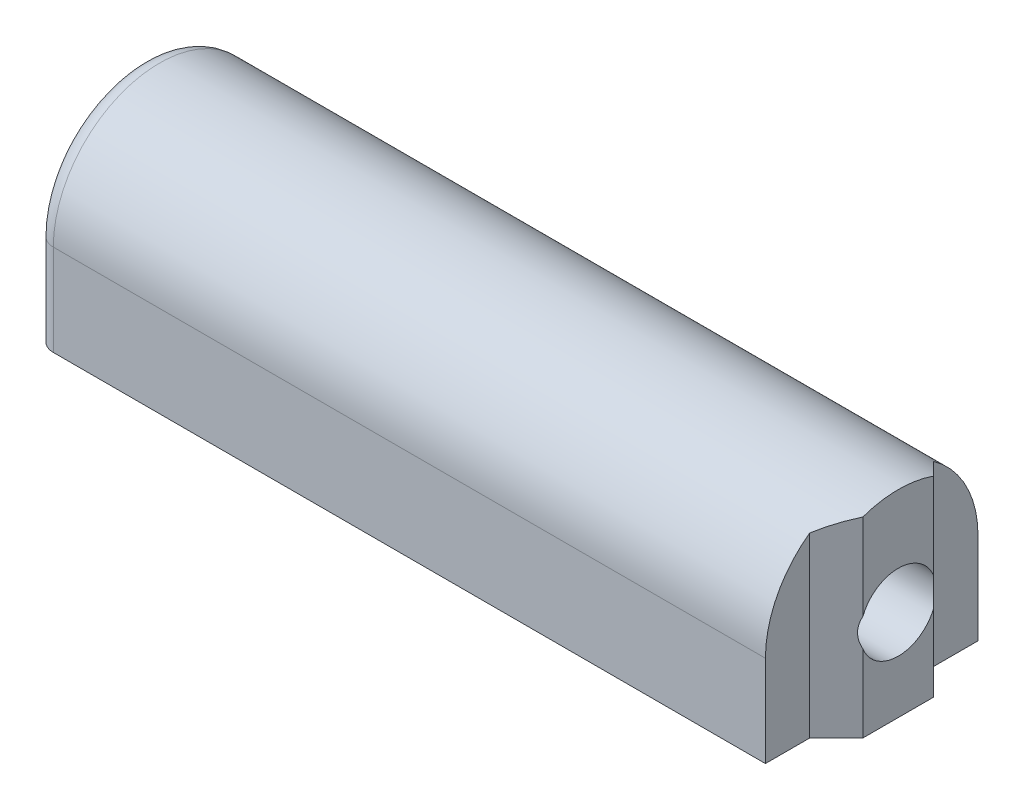
ISO-10303-21;
HEADER;
FILE_DESCRIPTION(('STEP AP214'),'2;1');
FILE_NAME('part.step','',(''),(''),'','','');
FILE_SCHEMA(('AUTOMOTIVE_DESIGN { 1 0 10303 214 1 1 1 1 }'));
ENDSEC;
DATA;
#1=APPLICATION_CONTEXT('core data for automotive mechanical design processes');
#2=APPLICATION_PROTOCOL_DEFINITION('international standard','automotive_design',2000,#1);
#3=PRODUCT_CONTEXT('',#1,'mechanical');
#4=PRODUCT('Part','Part','',(#3));
#5=PRODUCT_RELATED_PRODUCT_CATEGORY('part','',(#4));
#6=PRODUCT_DEFINITION_FORMATION('','',#4);
#7=PRODUCT_DEFINITION_CONTEXT('part definition',#1,'design');
#8=PRODUCT_DEFINITION('design','',#6,#7);
#9=PRODUCT_DEFINITION_SHAPE('','',#8);
#10=(LENGTH_UNIT() NAMED_UNIT(*) SI_UNIT(.MILLI.,.METRE.));
#11=(NAMED_UNIT(*) PLANE_ANGLE_UNIT() SI_UNIT($,.RADIAN.));
#12=(NAMED_UNIT(*) SI_UNIT($,.STERADIAN.) SOLID_ANGLE_UNIT());
#13=UNCERTAINTY_MEASURE_WITH_UNIT(LENGTH_MEASURE(1.E-05),#10,'distance_accuracy_value','');
#14=(GEOMETRIC_REPRESENTATION_CONTEXT(3) GLOBAL_UNCERTAINTY_ASSIGNED_CONTEXT((#13)) GLOBAL_UNIT_ASSIGNED_CONTEXT((#10,
#11,#12)) REPRESENTATION_CONTEXT('',''));
#15=CARTESIAN_POINT('',(0.,0.,0.));
#16=DIRECTION('',(0.,0.,1.));
#17=DIRECTION('',(1.,0.,0.));
#18=AXIS2_PLACEMENT_3D('',#15,#16,#17);
#19=CARTESIAN_POINT('',(0.,0.,12.));
#20=DIRECTION('',(0.,0.,-1.));
#21=DIRECTION('',(-1.,0.,0.));
#22=AXIS2_PLACEMENT_3D('',#19,#20,#21);
#23=PLANE('',#22);
#24=DIRECTION('',(-1.,0.,0.));
#25=VECTOR('',#24,1.);
#26=CARTESIAN_POINT('',(42.700025,5.15,12.));
#27=LINE('',#26,#25);
#28=CARTESIAN_POINT('',(41.2,5.15,12.));
#29=VERTEX_POINT('',#28);
#30=CARTESIAN_POINT('',(1.,5.15,12.));
#31=VERTEX_POINT('',#30);
#32=EDGE_CURVE('E145',#29,#31,#27,.T.);
#33=ORIENTED_EDGE('',*,*,#32,.T.);
#34=DIRECTION('',(0.,-1.,0.));
#35=VECTOR('',#34,1.);
#36=CARTESIAN_POINT('',(1.,0.,12.));
#37=LINE('',#36,#35);
#38=CARTESIAN_POINT('',(1.,0.,12.));
#39=VERTEX_POINT('',#38);
#40=EDGE_CURVE('E11',#31,#39,#37,.T.);
#41=ORIENTED_EDGE('',*,*,#40,.T.);
#42=DIRECTION('',(1.,0.,0.));
#43=VECTOR('',#42,1.);
#44=CARTESIAN_POINT('',(0.,0.,12.));
#45=LINE('',#44,#43);
#46=CARTESIAN_POINT('',(41.2,0.,12.));
#47=VERTEX_POINT('',#46);
#48=EDGE_CURVE('E151',#39,#47,#45,.T.);
#49=ORIENTED_EDGE('',*,*,#48,.T.);
#50=DIRECTION('',(0.,1.,0.));
#51=VECTOR('',#50,1.);
#52=CARTESIAN_POINT('',(41.2,0.,12.));
#53=LINE('',#52,#51);
#54=EDGE_CURVE('E154',#47,#29,#53,.T.);
#55=ORIENTED_EDGE('',*,*,#54,.T.);
#56=EDGE_LOOP('',(#33,#41,#49,#55));
#57=FACE_BOUND('',#56,.T.);
#58=ADVANCED_FACE('F36',(#57),#23,.F.);
#59=CARTESIAN_POINT('',(42.7,-7.15891053163818,8.));
#60=DIRECTION('',(1.,0.,0.));
#61=DIRECTION('',(0.,0.,-1.));
#62=AXIS2_PLACEMENT_3D('',#59,#60,#61);
#63=PLANE('',#62);
#64=CARTESIAN_POINT('',(42.7,5.15,6.));
#65=DIRECTION('',(-1.,0.,0.));
#66=DIRECTION('',(0.,0.,1.));
#67=AXIS2_PLACEMENT_3D('',#64,#65,#66);
#68=CIRCLE('',#67,6.);
#69=CARTESIAN_POINT('',(42.7,10.8068542494924,4.));
#70=VERTEX_POINT('',#69);
#71=CARTESIAN_POINT('',(42.7,10.8068542494924,8.));
#72=VERTEX_POINT('',#71);
#73=EDGE_CURVE('E198',#70,#72,#68,.F.);
#74=ORIENTED_EDGE('',*,*,#73,.T.);
#75=DIRECTION('',(0.,1.,0.));
#76=VECTOR('',#75,1.);
#77=CARTESIAN_POINT('',(42.7,-7.15891053163818,8.));
#78=LINE('',#77,#76);
#79=CARTESIAN_POINT('',(42.7,5.93898669190298,8.));
#80=VERTEX_POINT('',#79);
#81=EDGE_CURVE('E184',#80,#72,#78,.T.);
#82=ORIENTED_EDGE('',*,*,#81,.F.);
#83=CARTESIAN_POINT('',(42.7,5.15,6.));
#84=DIRECTION('',(-1.,0.,0.));
#85=DIRECTION('',(0.,0.,1.));
#86=AXIS2_PLACEMENT_3D('',#83,#84,#85);
#87=CIRCLE('',#86,2.15);
#88=CARTESIAN_POINT('',(42.7,5.93898669190298,4.));
#89=VERTEX_POINT('',#88);
#90=EDGE_CURVE('E193',#80,#89,#87,.T.);
#91=ORIENTED_EDGE('',*,*,#90,.T.);
#92=DIRECTION('',(0.,1.,0.));
#93=VECTOR('',#92,1.);
#94=CARTESIAN_POINT('',(42.7,-7.15891053163818,4.));
#95=LINE('',#94,#93);
#96=EDGE_CURVE('E261',#89,#70,#95,.T.);
#97=ORIENTED_EDGE('',*,*,#96,.T.);
#98=EDGE_LOOP('',(#74,#82,#91,#97));
#99=FACE_BOUND('',#98,.T.);
#100=ADVANCED_FACE('F259',(#99),#63,.T.);
#101=CARTESIAN_POINT('',(41.2,0.,12.));
#102=DIRECTION('',(-1.,0.,0.));
#103=DIRECTION('',(0.,0.,1.));
#104=AXIS2_PLACEMENT_3D('',#101,#102,#103);
#105=PLANE('',#104);
#106=DIRECTION('',(0.,1.,0.));
#107=VECTOR('',#106,1.);
#108=CARTESIAN_POINT('',(41.2,0.,0.));
#109=LINE('',#108,#107);
#110=CARTESIAN_POINT('',(41.2,0.,0.));
#111=VERTEX_POINT('',#110);
#112=CARTESIAN_POINT('',(41.2,5.15,0.));
#113=VERTEX_POINT('',#112);
#114=EDGE_CURVE('E143',#111,#113,#109,.T.);
#115=ORIENTED_EDGE('',*,*,#114,.T.);
#116=CARTESIAN_POINT('',(41.2,5.15,6.));
#117=DIRECTION('',(-1.,0.,0.));
#118=DIRECTION('',(0.,0.,1.));
#119=AXIS2_PLACEMENT_3D('',#116,#117,#118);
#120=CIRCLE('',#119,6.);
#121=CARTESIAN_POINT('',(41.2,10.0233971724045,2.5));
#122=VERTEX_POINT('',#121);
#123=EDGE_CURVE('E127',#113,#122,#120,.F.);
#124=ORIENTED_EDGE('',*,*,#123,.T.);
#125=DIRECTION('',(0.,1.,0.));
#126=VECTOR('',#125,1.);
#127=CARTESIAN_POINT('',(41.2,-7.15891053163818,2.5));
#128=LINE('',#127,#126);
#129=CARTESIAN_POINT('',(41.2,0.,2.5));
#130=VERTEX_POINT('',#129);
#131=EDGE_CURVE('E240',#130,#122,#128,.T.);
#132=ORIENTED_EDGE('',*,*,#131,.F.);
#133=DIRECTION('',(0.,0.,-1.));
#134=VECTOR('',#133,1.);
#135=CARTESIAN_POINT('',(41.2,0.,12.));
#136=LINE('',#135,#134);
#137=EDGE_CURVE('E150',#130,#111,#136,.T.);
#138=ORIENTED_EDGE('',*,*,#137,.T.);
#139=EDGE_LOOP('',(#115,#124,#132,#138));
#140=FACE_BOUND('',#139,.T.);
#141=ADVANCED_FACE('F148',(#140),#105,.F.);
#142=CARTESIAN_POINT('',(0.,0.,12.));
#143=DIRECTION('',(1.,0.,0.));
#144=DIRECTION('',(0.,0.,-1.));
#145=AXIS2_PLACEMENT_3D('',#142,#143,#144);
#146=PLANE('',#145);
#147=CARTESIAN_POINT('',(0.,5.15,6.));
#148=DIRECTION('',(-1.,0.,0.));
#149=DIRECTION('',(0.,0.,1.));
#150=AXIS2_PLACEMENT_3D('',#147,#148,#149);
#151=CIRCLE('',#150,2.15);
#152=CARTESIAN_POINT('',(0.,5.15,8.15));
#153=VERTEX_POINT('',#152);
#154=EDGE_CURVE('E138',#153,#153,#151,.T.);
#155=ORIENTED_EDGE('',*,*,#154,.F.);
#156=EDGE_LOOP('',(#155));
#157=FACE_BOUND('',#156,.T.);
#158=CARTESIAN_POINT('',(0.,5.15,6.));
#159=DIRECTION('',(1.,0.,0.));
#160=DIRECTION('',(0.,0.,-1.));
#161=AXIS2_PLACEMENT_3D('',#158,#159,#160);
#162=CIRCLE('',#161,5.);
#163=CARTESIAN_POINT('',(0.,5.15,11.));
#164=VERTEX_POINT('',#163);
#165=CARTESIAN_POINT('',(0.,5.15,1.));
#166=VERTEX_POINT('',#165);
#167=EDGE_CURVE('E205',#164,#166,#162,.F.);
#168=ORIENTED_EDGE('',*,*,#167,.T.);
#169=DIRECTION('',(0.,-1.,0.));
#170=VECTOR('',#169,1.);
#171=CARTESIAN_POINT('',(0.,0.,1.));
#172=LINE('',#171,#170);
#173=CARTESIAN_POINT('',(0.,0.,1.));
#174=VERTEX_POINT('',#173);
#175=EDGE_CURVE('E207',#166,#174,#172,.T.);
#176=ORIENTED_EDGE('',*,*,#175,.T.);
#177=DIRECTION('',(0.,0.,-1.));
#178=VECTOR('',#177,1.);
#179=CARTESIAN_POINT('',(0.,0.,12.));
#180=LINE('',#179,#178);
#181=CARTESIAN_POINT('',(0.,0.,11.));
#182=VERTEX_POINT('',#181);
#183=EDGE_CURVE('E162',#182,#174,#180,.T.);
#184=ORIENTED_EDGE('',*,*,#183,.F.);
#185=DIRECTION('',(0.,-1.,0.));
#186=VECTOR('',#185,1.);
#187=CARTESIAN_POINT('',(0.,0.,11.));
#188=LINE('',#187,#186);
#189=EDGE_CURVE('E203',#182,#164,#188,.F.);
#190=ORIENTED_EDGE('',*,*,#189,.T.);
#191=EDGE_LOOP('',(#168,#176,#184,#190));
#192=FACE_BOUND('',#191,.T.);
#193=ADVANCED_FACE('F223',(#157,#192),#146,.F.);
#194=CARTESIAN_POINT('',(0.,0.,12.));
#195=DIRECTION('',(0.,1.,0.));
#196=DIRECTION('',(0.,0.,1.));
#197=AXIS2_PLACEMENT_3D('',#194,#195,#196);
#198=PLANE('',#197);
#199=ORIENTED_EDGE('',*,*,#183,.T.);
#200=CARTESIAN_POINT('',(1.,0.,1.));
#201=DIRECTION('',(0.,1.,0.));
#202=DIRECTION('',(0.,0.,1.));
#203=AXIS2_PLACEMENT_3D('',#200,#201,#202);
#204=CIRCLE('',#203,1.);
#205=CARTESIAN_POINT('',(1.,0.,0.));
#206=VERTEX_POINT('',#205);
#207=EDGE_CURVE('E59',#174,#206,#204,.F.);
#208=ORIENTED_EDGE('',*,*,#207,.T.);
#209=DIRECTION('',(1.,0.,0.));
#210=VECTOR('',#209,1.);
#211=CARTESIAN_POINT('',(0.,0.,0.));
#212=LINE('',#211,#210);
#213=EDGE_CURVE('E152',#206,#111,#212,.T.);
#214=ORIENTED_EDGE('',*,*,#213,.T.);
#215=ORIENTED_EDGE('',*,*,#137,.F.);
#216=DIRECTION('',(0.707106781186548,0.,0.707106781186547));
#217=VECTOR('',#216,1.);
#218=CARTESIAN_POINT('',(42.7,0.,4.));
#219=LINE('',#218,#217);
#220=CARTESIAN_POINT('',(42.7,0.,4.));
#221=VERTEX_POINT('',#220);
#222=EDGE_CURVE('E239',#130,#221,#219,.T.);
#223=ORIENTED_EDGE('',*,*,#222,.T.);
#224=DIRECTION('',(0.,0.,1.));
#225=VECTOR('',#224,1.);
#226=CARTESIAN_POINT('',(42.7,0.,8.));
#227=LINE('',#226,#225);
#228=CARTESIAN_POINT('',(42.7,0.,8.));
#229=VERTEX_POINT('',#228);
#230=EDGE_CURVE('E237',#221,#229,#227,.T.);
#231=ORIENTED_EDGE('',*,*,#230,.T.);
#232=DIRECTION('',(-0.707106781186548,0.,0.707106781186548));
#233=VECTOR('',#232,1.);
#234=CARTESIAN_POINT('',(42.7,0.,8.));
#235=LINE('',#234,#233);
#236=CARTESIAN_POINT('',(41.2,0.,9.5));
#237=VERTEX_POINT('',#236);
#238=EDGE_CURVE('E156',#229,#237,#235,.T.);
#239=ORIENTED_EDGE('',*,*,#238,.T.);
#240=EDGE_CURVE('E167',#47,#237,#136,.T.);
#241=ORIENTED_EDGE('',*,*,#240,.F.);
#242=ORIENTED_EDGE('',*,*,#48,.F.);
#243=CARTESIAN_POINT('',(1.,0.,11.));
#244=DIRECTION('',(0.,1.,0.));
#245=DIRECTION('',(0.,0.,1.));
#246=AXIS2_PLACEMENT_3D('',#243,#244,#245);
#247=CIRCLE('',#246,1.);
#248=EDGE_CURVE('E209',#39,#182,#247,.F.);
#249=ORIENTED_EDGE('',*,*,#248,.T.);
#250=EDGE_LOOP('',(#199,#208,#214,#215,#223,#231,#239,#241,#242,#249));
#251=FACE_BOUND('',#250,.T.);
#252=ADVANCED_FACE('F225',(#251),#198,.F.);
#253=DIRECTION('',(0.,1.,0.));
#254=VECTOR('',#253,1.);
#255=CARTESIAN_POINT('',(41.2,-7.15891053163818,9.5));
#256=LINE('',#255,#254);
#257=CARTESIAN_POINT('',(41.2,10.0233971724045,9.5));
#258=VERTEX_POINT('',#257);
#259=EDGE_CURVE('E181',#237,#258,#256,.T.);
#260=ORIENTED_EDGE('',*,*,#259,.T.);
#261=CARTESIAN_POINT('',(41.2,5.15,6.));
#262=DIRECTION('',(-1.,0.,0.));
#263=DIRECTION('',(0.,0.,1.));
#264=AXIS2_PLACEMENT_3D('',#261,#262,#263);
#265=CIRCLE('',#264,6.);
#266=EDGE_CURVE('E201',#258,#29,#265,.F.);
#267=ORIENTED_EDGE('',*,*,#266,.T.);
#268=ORIENTED_EDGE('',*,*,#54,.F.);
#269=ORIENTED_EDGE('',*,*,#240,.T.);
#270=EDGE_LOOP('',(#260,#267,#268,#269));
#271=FACE_BOUND('',#270,.T.);
#272=ADVANCED_FACE('F255',(#271),#105,.F.);
#273=CARTESIAN_POINT('',(0.,0.,0.));
#274=DIRECTION('',(0.,0.,-1.));
#275=DIRECTION('',(-1.,0.,0.));
#276=AXIS2_PLACEMENT_3D('',#273,#274,#275);
#277=PLANE('',#276);
#278=ORIENTED_EDGE('',*,*,#213,.F.);
#279=DIRECTION('',(0.,-1.,0.));
#280=VECTOR('',#279,1.);
#281=CARTESIAN_POINT('',(1.,5.15,0.));
#282=LINE('',#281,#280);
#283=CARTESIAN_POINT('',(1.,5.15,0.));
#284=VERTEX_POINT('',#283);
#285=EDGE_CURVE('E45',#206,#284,#282,.F.);
#286=ORIENTED_EDGE('',*,*,#285,.T.);
#287=DIRECTION('',(-1.,0.,0.));
#288=VECTOR('',#287,1.);
#289=CARTESIAN_POINT('',(42.700025,5.15,0.));
#290=LINE('',#289,#288);
#291=EDGE_CURVE('E131',#113,#284,#290,.T.);
#292=ORIENTED_EDGE('',*,*,#291,.F.);
#293=ORIENTED_EDGE('',*,*,#114,.F.);
#294=EDGE_LOOP('',(#278,#286,#292,#293));
#295=FACE_BOUND('',#294,.T.);
#296=ADVANCED_FACE('F142',(#295),#277,.T.);
#297=CARTESIAN_POINT('',(42.7,-7.15891053163818,4.));
#298=DIRECTION('',(0.707106781186547,0.,-0.707106781186548));
#299=DIRECTION('',(-0.707106781186548,0.,-0.707106781186547));
#300=AXIS2_PLACEMENT_3D('',#297,#298,#299);
#301=PLANE('',#300);
#302=CARTESIAN_POINT('',(44.7,5.15,6.));
#303=DIRECTION('',(0.707106781186547,0.,-0.707106781186548));
#304=DIRECTION('',(-0.707106781186548,0.,-0.707106781186547));
#305=AXIS2_PLACEMENT_3D('',#302,#303,#304);
#306=ELLIPSE('',#305,8.48528137423857,6.);
#307=EDGE_CURVE('E134',#70,#122,#306,.F.);
#308=ORIENTED_EDGE('',*,*,#307,.F.);
#309=ORIENTED_EDGE('',*,*,#96,.F.);
#310=CARTESIAN_POINT('',(44.7,5.15,6.));
#311=DIRECTION('',(0.707106781186547,0.,-0.707106781186548));
#312=DIRECTION('',(-0.707106781186548,0.,-0.707106781186547));
#313=AXIS2_PLACEMENT_3D('',#310,#311,#312);
#314=ELLIPSE('',#313,3.04055915910216,2.15);
#315=CARTESIAN_POINT('',(42.7,4.36101330809702,4.));
#316=VERTEX_POINT('',#315);
#317=EDGE_CURVE('E185',#316,#89,#314,.T.);
#318=ORIENTED_EDGE('',*,*,#317,.F.);
#319=EDGE_CURVE('E242',#221,#316,#95,.T.);
#320=ORIENTED_EDGE('',*,*,#319,.F.);
#321=ORIENTED_EDGE('',*,*,#222,.F.);
#322=ORIENTED_EDGE('',*,*,#131,.T.);
#323=EDGE_LOOP('',(#308,#309,#318,#320,#321,#322));
#324=FACE_BOUND('',#323,.T.);
#325=ADVANCED_FACE('F270',(#324),#301,.T.);
#326=CARTESIAN_POINT('',(42.7,5.15,6.));
#327=DIRECTION('',(-1.,0.,0.));
#328=DIRECTION('',(0.,0.,1.));
#329=AXIS2_PLACEMENT_3D('',#326,#327,#328);
#330=CIRCLE('',#329,2.15);
#331=CARTESIAN_POINT('',(42.7,4.36101330809702,8.));
#332=VERTEX_POINT('',#331);
#333=EDGE_CURVE('E190',#316,#332,#330,.T.);
#334=ORIENTED_EDGE('',*,*,#333,.T.);
#335=EDGE_CURVE('E178',#229,#332,#78,.T.);
#336=ORIENTED_EDGE('',*,*,#335,.F.);
#337=ORIENTED_EDGE('',*,*,#230,.F.);
#338=ORIENTED_EDGE('',*,*,#319,.T.);
#339=EDGE_LOOP('',(#334,#336,#337,#338));
#340=FACE_BOUND('',#339,.T.);
#341=ADVANCED_FACE('F266',(#340),#63,.T.);
#342=CARTESIAN_POINT('',(42.7,-7.15891053163818,8.));
#343=DIRECTION('',(0.707106781186547,0.,0.707106781186547));
#344=DIRECTION('',(0.707106781186548,0.,-0.707106781186548));
#345=AXIS2_PLACEMENT_3D('',#342,#343,#344);
#346=PLANE('',#345);
#347=CARTESIAN_POINT('',(44.7,5.15,6.));
#348=DIRECTION('',(0.707106781186547,0.,0.707106781186547));
#349=DIRECTION('',(-0.707106781186548,0.,0.707106781186548));
#350=AXIS2_PLACEMENT_3D('',#347,#348,#349);
#351=ELLIPSE('',#350,8.48528137423857,6.);
#352=EDGE_CURVE('E189',#258,#72,#351,.F.);
#353=ORIENTED_EDGE('',*,*,#352,.F.);
#354=ORIENTED_EDGE('',*,*,#259,.F.);
#355=ORIENTED_EDGE('',*,*,#238,.F.);
#356=ORIENTED_EDGE('',*,*,#335,.T.);
#357=CARTESIAN_POINT('',(44.7,5.15,6.));
#358=DIRECTION('',(0.707106781186547,0.,0.707106781186547));
#359=DIRECTION('',(-0.707106781186548,0.,0.707106781186548));
#360=AXIS2_PLACEMENT_3D('',#357,#358,#359);
#361=ELLIPSE('',#360,3.04055915910216,2.15);
#362=EDGE_CURVE('E173',#80,#332,#361,.T.);
#363=ORIENTED_EDGE('',*,*,#362,.F.);
#364=ORIENTED_EDGE('',*,*,#81,.T.);
#365=EDGE_LOOP('',(#353,#354,#355,#356,#363,#364));
#366=FACE_BOUND('',#365,.T.);
#367=ADVANCED_FACE('F253',(#366),#346,.T.);
#368=CARTESIAN_POINT('',(42.700025,5.15,6.));
#369=DIRECTION('',(-1.,0.,0.));
#370=DIRECTION('',(0.,0.,1.));
#371=AXIS2_PLACEMENT_3D('',#368,#369,#370);
#372=CYLINDRICAL_SURFACE('',#371,2.15);
#373=ORIENTED_EDGE('',*,*,#317,.T.);
#374=ORIENTED_EDGE('',*,*,#90,.F.);
#375=ORIENTED_EDGE('',*,*,#362,.T.);
#376=ORIENTED_EDGE('',*,*,#333,.F.);
#377=EDGE_LOOP('',(#373,#374,#375,#376));
#378=FACE_BOUND('',#377,.T.);
#379=ORIENTED_EDGE('',*,*,#154,.T.);
#380=EDGE_LOOP('',(#379));
#381=FACE_BOUND('',#380,.T.);
#382=ADVANCED_FACE('F272',(#378,#381),#372,.F.);
#383=CARTESIAN_POINT('',(42.700025,5.15,6.));
#384=DIRECTION('',(-1.,0.,0.));
#385=DIRECTION('',(0.,0.,1.));
#386=AXIS2_PLACEMENT_3D('',#383,#384,#385);
#387=CYLINDRICAL_SURFACE('',#386,6.);
#388=ORIENTED_EDGE('',*,*,#291,.T.);
#389=CARTESIAN_POINT('',(1.,5.15,6.));
#390=DIRECTION('',(1.,0.,0.));
#391=DIRECTION('',(0.,0.,-1.));
#392=AXIS2_PLACEMENT_3D('',#389,#390,#391);
#393=CIRCLE('',#392,6.);
#394=EDGE_CURVE('E197',#284,#31,#393,.T.);
#395=ORIENTED_EDGE('',*,*,#394,.T.);
#396=ORIENTED_EDGE('',*,*,#32,.F.);
#397=ORIENTED_EDGE('',*,*,#266,.F.);
#398=ORIENTED_EDGE('',*,*,#352,.T.);
#399=ORIENTED_EDGE('',*,*,#73,.F.);
#400=ORIENTED_EDGE('',*,*,#307,.T.);
#401=ORIENTED_EDGE('',*,*,#123,.F.);
#402=EDGE_LOOP('',(#388,#395,#396,#397,#398,#399,#400,#401));
#403=FACE_BOUND('',#402,.T.);
#404=ADVANCED_FACE('F129',(#403),#387,.T.);
#405=CARTESIAN_POINT('',(1.,0.,1.));
#406=DIRECTION('',(0.,1.,0.));
#407=DIRECTION('',(0.,0.,1.));
#408=AXIS2_PLACEMENT_3D('',#405,#406,#407);
#409=CYLINDRICAL_SURFACE('',#408,1.);
#410=ORIENTED_EDGE('',*,*,#207,.F.);
#411=ORIENTED_EDGE('',*,*,#175,.F.);
#412=CARTESIAN_POINT('',(1.,5.15,1.));
#413=DIRECTION('',(0.,1.,0.));
#414=DIRECTION('',(0.,0.,1.));
#415=AXIS2_PLACEMENT_3D('',#412,#413,#414);
#416=CIRCLE('',#415,1.);
#417=EDGE_CURVE('E40',#284,#166,#416,.T.);
#418=ORIENTED_EDGE('',*,*,#417,.F.);
#419=ORIENTED_EDGE('',*,*,#285,.F.);
#420=EDGE_LOOP('',(#410,#411,#418,#419));
#421=FACE_BOUND('',#420,.T.);
#422=ADVANCED_FACE('F38',(#421),#409,.T.);
#423=CARTESIAN_POINT('',(1.,0.,11.));
#424=DIRECTION('',(0.,-1.,0.));
#425=DIRECTION('',(0.,0.,-1.));
#426=AXIS2_PLACEMENT_3D('',#423,#424,#425);
#427=CYLINDRICAL_SURFACE('',#426,1.);
#428=ORIENTED_EDGE('',*,*,#248,.F.);
#429=ORIENTED_EDGE('',*,*,#40,.F.);
#430=CARTESIAN_POINT('',(1.,5.15,11.));
#431=DIRECTION('',(0.,1.,0.));
#432=DIRECTION('',(0.,0.,1.));
#433=AXIS2_PLACEMENT_3D('',#430,#431,#432);
#434=CIRCLE('',#433,1.);
#435=EDGE_CURVE('E212',#164,#31,#434,.T.);
#436=ORIENTED_EDGE('',*,*,#435,.F.);
#437=ORIENTED_EDGE('',*,*,#189,.F.);
#438=EDGE_LOOP('',(#428,#429,#436,#437));
#439=FACE_BOUND('',#438,.T.);
#440=ADVANCED_FACE('F228',(#439),#427,.T.);
#441=CARTESIAN_POINT('',(1.,5.15,6.));
#442=DIRECTION('',(1.,0.,0.));
#443=DIRECTION('',(0.,0.,-1.));
#444=AXIS2_PLACEMENT_3D('',#441,#442,#443);
#445=TOROIDAL_SURFACE('',#444,5.,1.);
#446=ORIENTED_EDGE('',*,*,#417,.T.);
#447=ORIENTED_EDGE('',*,*,#167,.F.);
#448=ORIENTED_EDGE('',*,*,#435,.T.);
#449=ORIENTED_EDGE('',*,*,#394,.F.);
#450=EDGE_LOOP('',(#446,#447,#448,#449));
#451=FACE_BOUND('',#450,.T.);
#452=ADVANCED_FACE('F218',(#451),#445,.T.);
#453=CLOSED_SHELL('',(#58,#100,#141,#193,#252,#272,#296,#325,#341,#367,#382,#404,#422,#440,#452));
#454=MANIFOLD_SOLID_BREP('B2',#453);
#455=ADVANCED_BREP_SHAPE_REPRESENTATION('',(#18,#454),#14);
#456=SHAPE_DEFINITION_REPRESENTATION(#9,#455);
ENDSEC;
END-ISO-10303-21;
